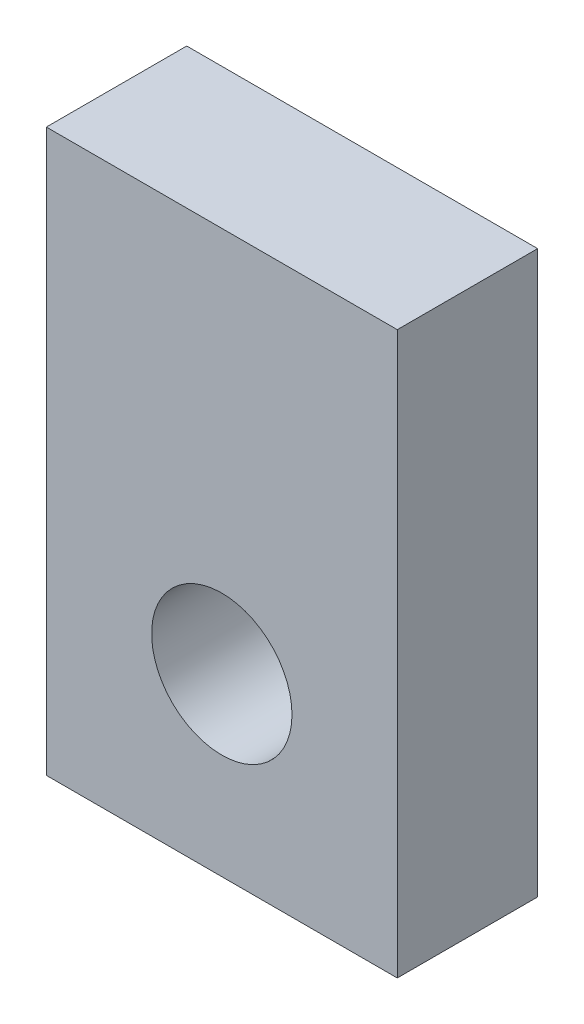
ISO-10303-21;
HEADER;
FILE_DESCRIPTION(('STEP AP214'),'2;1');
FILE_NAME('part.step','',(''),(''),'','','');
FILE_SCHEMA(('AUTOMOTIVE_DESIGN { 1 0 10303 214 1 1 1 1 }'));
ENDSEC;
DATA;
#1=APPLICATION_CONTEXT('core data for automotive mechanical design processes');
#2=APPLICATION_PROTOCOL_DEFINITION('international standard','automotive_design',2000,#1);
#3=PRODUCT_CONTEXT('',#1,'mechanical');
#4=PRODUCT('Part','Part','',(#3));
#5=PRODUCT_RELATED_PRODUCT_CATEGORY('part','',(#4));
#6=PRODUCT_DEFINITION_FORMATION('','',#4);
#7=PRODUCT_DEFINITION_CONTEXT('part definition',#1,'design');
#8=PRODUCT_DEFINITION('design','',#6,#7);
#9=PRODUCT_DEFINITION_SHAPE('','',#8);
#10=(LENGTH_UNIT() NAMED_UNIT(*) SI_UNIT(.MILLI.,.METRE.));
#11=(NAMED_UNIT(*) PLANE_ANGLE_UNIT() SI_UNIT($,.RADIAN.));
#12=(NAMED_UNIT(*) SI_UNIT($,.STERADIAN.) SOLID_ANGLE_UNIT());
#13=UNCERTAINTY_MEASURE_WITH_UNIT(LENGTH_MEASURE(1.E-05),#10,'distance_accuracy_value','');
#14=(GEOMETRIC_REPRESENTATION_CONTEXT(3) GLOBAL_UNCERTAINTY_ASSIGNED_CONTEXT((#13)) GLOBAL_UNIT_ASSIGNED_CONTEXT((#10,
#11,#12)) REPRESENTATION_CONTEXT('',''));
#15=CARTESIAN_POINT('',(0.,0.,0.));
#16=DIRECTION('',(0.,0.,1.));
#17=DIRECTION('',(1.,0.,0.));
#18=AXIS2_PLACEMENT_3D('',#15,#16,#17);
#19=CARTESIAN_POINT('',(0.,16.,0.));
#20=DIRECTION('',(-1.,0.,0.));
#21=DIRECTION('',(0.,0.,1.));
#22=AXIS2_PLACEMENT_3D('',#19,#20,#21);
#23=PLANE('',#22);
#24=DIRECTION('',(0.,0.,-1.));
#25=VECTOR('',#24,1.);
#26=CARTESIAN_POINT('',(0.,0.,0.));
#27=LINE('',#26,#25);
#28=CARTESIAN_POINT('',(0.,0.,0.));
#29=VERTEX_POINT('',#28);
#30=CARTESIAN_POINT('',(0.,0.,-4.));
#31=VERTEX_POINT('',#30);
#32=EDGE_CURVE('E94',#29,#31,#27,.T.);
#33=ORIENTED_EDGE('',*,*,#32,.T.);
#34=DIRECTION('',(0.,-1.,0.));
#35=VECTOR('',#34,1.);
#36=CARTESIAN_POINT('',(0.,16.,-4.));
#37=LINE('',#36,#35);
#38=CARTESIAN_POINT('',(0.,16.,-4.));
#39=VERTEX_POINT('',#38);
#40=EDGE_CURVE('E11',#39,#31,#37,.T.);
#41=ORIENTED_EDGE('',*,*,#40,.F.);
#42=DIRECTION('',(0.,0.,-1.));
#43=VECTOR('',#42,1.);
#44=CARTESIAN_POINT('',(0.,16.,0.));
#45=LINE('',#44,#43);
#46=CARTESIAN_POINT('',(0.,16.,0.));
#47=VERTEX_POINT('',#46);
#48=EDGE_CURVE('E82',#47,#39,#45,.T.);
#49=ORIENTED_EDGE('',*,*,#48,.F.);
#50=DIRECTION('',(0.,-1.,0.));
#51=VECTOR('',#50,1.);
#52=CARTESIAN_POINT('',(0.,16.,0.));
#53=LINE('',#52,#51);
#54=EDGE_CURVE('E90',#47,#29,#53,.T.);
#55=ORIENTED_EDGE('',*,*,#54,.T.);
#56=EDGE_LOOP('',(#33,#41,#49,#55));
#57=FACE_BOUND('',#56,.T.);
#58=ADVANCED_FACE('F31',(#57),#23,.F.);
#59=CARTESIAN_POINT('',(0.,16.,-4.));
#60=DIRECTION('',(0.,0.,1.));
#61=DIRECTION('',(1.,0.,0.));
#62=AXIS2_PLACEMENT_3D('',#59,#60,#61);
#63=PLANE('',#62);
#64=CARTESIAN_POINT('',(-5.,5.,-4.));
#65=DIRECTION('',(0.,0.,1.));
#66=DIRECTION('',(1.,0.,0.));
#67=AXIS2_PLACEMENT_3D('',#64,#65,#66);
#68=CIRCLE('',#67,2.);
#69=CARTESIAN_POINT('',(-3.,5.,-4.));
#70=VERTEX_POINT('',#69);
#71=EDGE_CURVE('E97',#70,#70,#68,.T.);
#72=ORIENTED_EDGE('',*,*,#71,.T.);
#73=EDGE_LOOP('',(#72));
#74=FACE_BOUND('',#73,.T.);
#75=DIRECTION('',(-1.,0.,0.));
#76=VECTOR('',#75,1.);
#77=CARTESIAN_POINT('',(0.,0.,-4.));
#78=LINE('',#77,#76);
#79=CARTESIAN_POINT('',(-10.,0.,-4.));
#80=VERTEX_POINT('',#79);
#81=EDGE_CURVE('E86',#31,#80,#78,.T.);
#82=ORIENTED_EDGE('',*,*,#81,.T.);
#83=DIRECTION('',(0.,-1.,0.));
#84=VECTOR('',#83,1.);
#85=CARTESIAN_POINT('',(-10.,16.,-4.));
#86=LINE('',#85,#84);
#87=CARTESIAN_POINT('',(-10.,16.,-4.));
#88=VERTEX_POINT('',#87);
#89=EDGE_CURVE('E39',#88,#80,#86,.T.);
#90=ORIENTED_EDGE('',*,*,#89,.F.);
#91=DIRECTION('',(-1.,0.,0.));
#92=VECTOR('',#91,1.);
#93=CARTESIAN_POINT('',(0.,16.,-4.));
#94=LINE('',#93,#92);
#95=EDGE_CURVE('E77',#39,#88,#94,.T.);
#96=ORIENTED_EDGE('',*,*,#95,.F.);
#97=ORIENTED_EDGE('',*,*,#40,.T.);
#98=EDGE_LOOP('',(#82,#90,#96,#97));
#99=FACE_BOUND('',#98,.T.);
#100=ADVANCED_FACE('F85',(#74,#99),#63,.F.);
#101=CARTESIAN_POINT('',(-10.,16.,0.));
#102=DIRECTION('',(1.,0.,0.));
#103=DIRECTION('',(0.,0.,-1.));
#104=AXIS2_PLACEMENT_3D('',#101,#102,#103);
#105=PLANE('',#104);
#106=DIRECTION('',(0.,0.,1.));
#107=VECTOR('',#106,1.);
#108=CARTESIAN_POINT('',(-10.,0.,0.));
#109=LINE('',#108,#107);
#110=CARTESIAN_POINT('',(-10.,0.,0.));
#111=VERTEX_POINT('',#110);
#112=EDGE_CURVE('E64',#80,#111,#109,.T.);
#113=ORIENTED_EDGE('',*,*,#112,.T.);
#114=DIRECTION('',(0.,-1.,0.));
#115=VECTOR('',#114,1.);
#116=CARTESIAN_POINT('',(-10.,16.,0.));
#117=LINE('',#116,#115);
#118=CARTESIAN_POINT('',(-10.,16.,0.));
#119=VERTEX_POINT('',#118);
#120=EDGE_CURVE('E87',#119,#111,#117,.T.);
#121=ORIENTED_EDGE('',*,*,#120,.F.);
#122=DIRECTION('',(0.,0.,1.));
#123=VECTOR('',#122,1.);
#124=CARTESIAN_POINT('',(-10.,16.,0.));
#125=LINE('',#124,#123);
#126=EDGE_CURVE('E80',#88,#119,#125,.T.);
#127=ORIENTED_EDGE('',*,*,#126,.F.);
#128=ORIENTED_EDGE('',*,*,#89,.T.);
#129=EDGE_LOOP('',(#113,#121,#127,#128));
#130=FACE_BOUND('',#129,.T.);
#131=ADVANCED_FACE('F88',(#130),#105,.F.);
#132=CARTESIAN_POINT('',(0.,16.,0.));
#133=DIRECTION('',(0.,0.,-1.));
#134=DIRECTION('',(-1.,0.,0.));
#135=AXIS2_PLACEMENT_3D('',#132,#133,#134);
#136=PLANE('',#135);
#137=CARTESIAN_POINT('',(-5.,5.,0.));
#138=DIRECTION('',(0.,0.,1.));
#139=DIRECTION('',(1.,0.,0.));
#140=AXIS2_PLACEMENT_3D('',#137,#138,#139);
#141=CIRCLE('',#140,2.);
#142=CARTESIAN_POINT('',(-3.,5.,0.));
#143=VERTEX_POINT('',#142);
#144=EDGE_CURVE('E108',#143,#143,#141,.T.);
#145=ORIENTED_EDGE('',*,*,#144,.F.);
#146=EDGE_LOOP('',(#145));
#147=FACE_BOUND('',#146,.T.);
#148=DIRECTION('',(1.,0.,0.));
#149=VECTOR('',#148,1.);
#150=CARTESIAN_POINT('',(0.,0.,0.));
#151=LINE('',#150,#149);
#152=EDGE_CURVE('E70',#111,#29,#151,.T.);
#153=ORIENTED_EDGE('',*,*,#152,.T.);
#154=ORIENTED_EDGE('',*,*,#54,.F.);
#155=DIRECTION('',(1.,0.,0.));
#156=VECTOR('',#155,1.);
#157=CARTESIAN_POINT('',(0.,16.,0.));
#158=LINE('',#157,#156);
#159=EDGE_CURVE('E47',#119,#47,#158,.T.);
#160=ORIENTED_EDGE('',*,*,#159,.F.);
#161=ORIENTED_EDGE('',*,*,#120,.T.);
#162=EDGE_LOOP('',(#153,#154,#160,#161));
#163=FACE_BOUND('',#162,.T.);
#164=ADVANCED_FACE('F102',(#147,#163),#136,.F.);
#165=CARTESIAN_POINT('',(0.,16.,-4.));
#166=DIRECTION('',(0.,1.,0.));
#167=DIRECTION('',(0.,0.,1.));
#168=AXIS2_PLACEMENT_3D('',#165,#166,#167);
#169=PLANE('',#168);
#170=ORIENTED_EDGE('',*,*,#48,.T.);
#171=ORIENTED_EDGE('',*,*,#95,.T.);
#172=ORIENTED_EDGE('',*,*,#126,.T.);
#173=ORIENTED_EDGE('',*,*,#159,.T.);
#174=EDGE_LOOP('',(#170,#171,#172,#173));
#175=FACE_BOUND('',#174,.T.);
#176=ADVANCED_FACE('F78',(#175),#169,.T.);
#177=CARTESIAN_POINT('',(0.,0.,-4.));
#178=DIRECTION('',(0.,1.,0.));
#179=DIRECTION('',(0.,0.,1.));
#180=AXIS2_PLACEMENT_3D('',#177,#178,#179);
#181=PLANE('',#180);
#182=ORIENTED_EDGE('',*,*,#32,.F.);
#183=ORIENTED_EDGE('',*,*,#152,.F.);
#184=ORIENTED_EDGE('',*,*,#112,.F.);
#185=ORIENTED_EDGE('',*,*,#81,.F.);
#186=EDGE_LOOP('',(#182,#183,#184,#185));
#187=FACE_BOUND('',#186,.T.);
#188=ADVANCED_FACE('F105',(#187),#181,.F.);
#189=CARTESIAN_POINT('',(-5.,5.,-4.));
#190=DIRECTION('',(0.,0.,1.));
#191=DIRECTION('',(1.,0.,0.));
#192=AXIS2_PLACEMENT_3D('',#189,#190,#191);
#193=CYLINDRICAL_SURFACE('',#192,2.);
#194=ORIENTED_EDGE('',*,*,#71,.F.);
#195=EDGE_LOOP('',(#194));
#196=FACE_BOUND('',#195,.T.);
#197=ORIENTED_EDGE('',*,*,#144,.T.);
#198=EDGE_LOOP('',(#197));
#199=FACE_BOUND('',#198,.T.);
#200=ADVANCED_FACE('F115',(#196,#199),#193,.F.);
#201=CLOSED_SHELL('',(#58,#100,#131,#164,#176,#188,#200));
#202=MANIFOLD_SOLID_BREP('B2',#201);
#203=ADVANCED_BREP_SHAPE_REPRESENTATION('',(#18,#202),#14);
#204=SHAPE_DEFINITION_REPRESENTATION(#9,#203);
ENDSEC;
END-ISO-10303-21;
